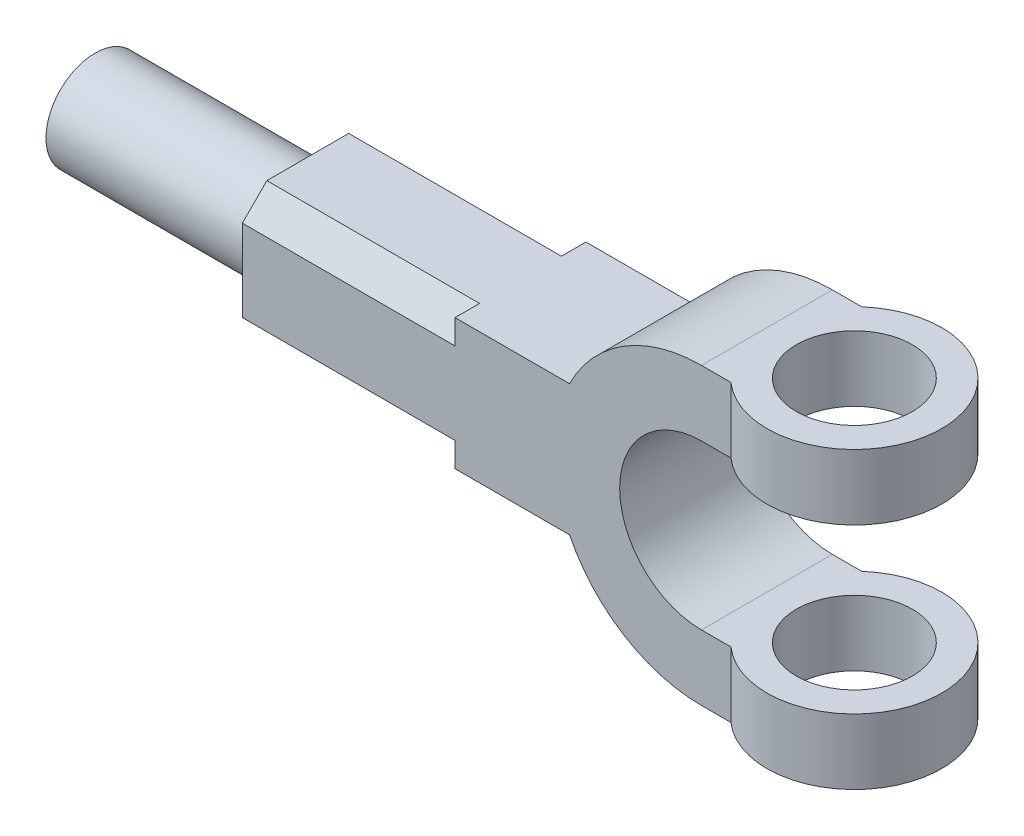
ISO-10303-21;
HEADER;
FILE_DESCRIPTION(('STEP AP214'),'2;1');
FILE_NAME('part.step','',(''),(''),'','','');
FILE_SCHEMA(('AUTOMOTIVE_DESIGN { 1 0 10303 214 1 1 1 1 }'));
ENDSEC;
DATA;
#1=APPLICATION_CONTEXT('core data for automotive mechanical design processes');
#2=APPLICATION_PROTOCOL_DEFINITION('international standard','automotive_design',2000,#1);
#3=PRODUCT_CONTEXT('',#1,'mechanical');
#4=PRODUCT('Part','Part','',(#3));
#5=PRODUCT_RELATED_PRODUCT_CATEGORY('part','',(#4));
#6=PRODUCT_DEFINITION_FORMATION('','',#4);
#7=PRODUCT_DEFINITION_CONTEXT('part definition',#1,'design');
#8=PRODUCT_DEFINITION('design','',#6,#7);
#9=PRODUCT_DEFINITION_SHAPE('','',#8);
#10=(LENGTH_UNIT() NAMED_UNIT(*) SI_UNIT(.MILLI.,.METRE.));
#11=(NAMED_UNIT(*) PLANE_ANGLE_UNIT() SI_UNIT($,.RADIAN.));
#12=(NAMED_UNIT(*) SI_UNIT($,.STERADIAN.) SOLID_ANGLE_UNIT());
#13=UNCERTAINTY_MEASURE_WITH_UNIT(LENGTH_MEASURE(1.E-05),#10,'distance_accuracy_value','');
#14=(GEOMETRIC_REPRESENTATION_CONTEXT(3) GLOBAL_UNCERTAINTY_ASSIGNED_CONTEXT((#13)) GLOBAL_UNIT_ASSIGNED_CONTEXT((#10,
#11,#12)) REPRESENTATION_CONTEXT('',''));
#15=CARTESIAN_POINT('',(0.,0.,0.));
#16=DIRECTION('',(0.,0.,1.));
#17=DIRECTION('',(1.,0.,0.));
#18=AXIS2_PLACEMENT_3D('',#15,#16,#17);
#19=CARTESIAN_POINT('',(-140.311288741493,0.,20.));
#20=DIRECTION('',(1.,0.,0.));
#21=DIRECTION('',(0.,0.,-1.));
#22=AXIS2_PLACEMENT_3D('',#19,#20,#21);
#23=PLANE('',#22);
#24=DIRECTION('',(0.,-1.,0.));
#25=VECTOR('',#24,1.);
#26=CARTESIAN_POINT('',(-140.311288741493,0.,-20.));
#27=LINE('',#26,#25);
#28=CARTESIAN_POINT('',(-140.311288741493,12.5,-20.));
#29=VERTEX_POINT('',#28);
#30=CARTESIAN_POINT('',(-140.311288741493,-12.4999999999998,-20.0000000000002));
#31=VERTEX_POINT('',#30);
#32=EDGE_CURVE('E320',#29,#31,#27,.T.);
#33=ORIENTED_EDGE('',*,*,#32,.T.);
#34=DIRECTION('',(0.,0.707106781186552,-0.707106781186543));
#35=VECTOR('',#34,1.);
#36=CARTESIAN_POINT('',(-140.311288741493,-12.4999999999998,-20.0000000000002));
#37=LINE('',#36,#35);
#38=CARTESIAN_POINT('',(-140.311288741493,-19.9999999999999,-12.5000000000002));
#39=VERTEX_POINT('',#38);
#40=EDGE_CURVE('E203',#39,#31,#37,.T.);
#41=ORIENTED_EDGE('',*,*,#40,.F.);
#42=DIRECTION('',(0.,0.,-1.));
#43=VECTOR('',#42,1.);
#44=CARTESIAN_POINT('',(-140.311288741493,-20.,20.));
#45=LINE('',#44,#43);
#46=CARTESIAN_POINT('',(-140.311288741493,-20.,12.5));
#47=VERTEX_POINT('',#46);
#48=EDGE_CURVE('E208',#47,#39,#45,.T.);
#49=ORIENTED_EDGE('',*,*,#48,.F.);
#50=DIRECTION('',(0.,-0.70710678118655,-0.707106781186545));
#51=VECTOR('',#50,1.);
#52=CARTESIAN_POINT('',(-140.311288741493,-20.,12.5));
#53=LINE('',#52,#51);
#54=CARTESIAN_POINT('',(-140.311288741493,-12.5,20.));
#55=VERTEX_POINT('',#54);
#56=EDGE_CURVE('E215',#55,#47,#53,.T.);
#57=ORIENTED_EDGE('',*,*,#56,.F.);
#58=DIRECTION('',(0.,-1.,0.));
#59=VECTOR('',#58,1.);
#60=CARTESIAN_POINT('',(-140.311288741493,0.,20.));
#61=LINE('',#60,#59);
#62=CARTESIAN_POINT('',(-140.311288741493,12.4999999999999,20.0000000000001));
#63=VERTEX_POINT('',#62);
#64=EDGE_CURVE('E352',#63,#55,#61,.T.);
#65=ORIENTED_EDGE('',*,*,#64,.F.);
#66=DIRECTION('',(0.,-0.707106781186547,0.707106781186548));
#67=VECTOR('',#66,1.);
#68=CARTESIAN_POINT('',(-140.311288741493,12.4999999999999,20.0000000000001));
#69=LINE('',#68,#67);
#70=CARTESIAN_POINT('',(-140.311288741493,20.,12.5));
#71=VERTEX_POINT('',#70);
#72=EDGE_CURVE('E234',#71,#63,#69,.T.);
#73=ORIENTED_EDGE('',*,*,#72,.F.);
#74=DIRECTION('',(0.,0.,-1.));
#75=VECTOR('',#74,1.);
#76=CARTESIAN_POINT('',(-140.311288741493,20.,20.));
#77=LINE('',#76,#75);
#78=CARTESIAN_POINT('',(-140.311288741493,20.,-12.5));
#79=VERTEX_POINT('',#78);
#80=EDGE_CURVE('E400',#71,#79,#77,.T.);
#81=ORIENTED_EDGE('',*,*,#80,.T.);
#82=DIRECTION('',(0.,0.70710678118655,0.707106781186545));
#83=VECTOR('',#82,1.);
#84=CARTESIAN_POINT('',(-140.311288741493,20.,-12.5));
#85=LINE('',#84,#83);
#86=EDGE_CURVE('E260',#29,#79,#85,.T.);
#87=ORIENTED_EDGE('',*,*,#86,.F.);
#88=EDGE_LOOP('',(#33,#41,#49,#57,#65,#73,#81,#87));
#89=FACE_BOUND('',#88,.T.);
#90=CARTESIAN_POINT('',(-140.311288741493,0.,0.));
#91=DIRECTION('',(1.,0.,0.));
#92=DIRECTION('',(0.,0.,-1.));
#93=AXIS2_PLACEMENT_3D('',#90,#91,#92);
#94=CIRCLE('',#93,15.);
#95=CARTESIAN_POINT('',(-140.311288741493,0.,-15.));
#96=VERTEX_POINT('',#95);
#97=EDGE_CURVE('E11',#96,#96,#94,.F.);
#98=ORIENTED_EDGE('',*,*,#97,.F.);
#99=EDGE_LOOP('',(#98));
#100=FACE_BOUND('',#99,.T.);
#101=ADVANCED_FACE('F48',(#89,#100),#23,.F.);
#102=CARTESIAN_POINT('',(0.,-20.,20.));
#103=DIRECTION('',(0.,-1.,0.));
#104=DIRECTION('',(1.,0.,0.));
#105=AXIS2_PLACEMENT_3D('',#102,#103,#104);
#106=PLANE('',#105);
#107=DIRECTION('',(-1.,0.,0.));
#108=VECTOR('',#107,1.);
#109=CARTESIAN_POINT('',(-75.3112887414927,-19.9999999999999,-12.5000000000002));
#110=LINE('',#109,#108);
#111=CARTESIAN_POINT('',(-75.3112887414927,-19.9999999999999,-12.5000000000002));
#112=VERTEX_POINT('',#111);
#113=EDGE_CURVE('E188',#112,#39,#110,.T.);
#114=ORIENTED_EDGE('',*,*,#113,.F.);
#115=DIRECTION('',(0.,0.,1.));
#116=VECTOR('',#115,1.);
#117=CARTESIAN_POINT('',(-75.3112887414927,-19.9999999999998,-20.0000000000002));
#118=LINE('',#117,#116);
#119=CARTESIAN_POINT('',(-75.3112887414927,-19.9999999999998,-20.0000000000002));
#120=VERTEX_POINT('',#119);
#121=EDGE_CURVE('E195',#120,#112,#118,.T.);
#122=ORIENTED_EDGE('',*,*,#121,.F.);
#123=DIRECTION('',(-1.,0.,0.));
#124=VECTOR('',#123,1.);
#125=CARTESIAN_POINT('',(0.,-20.,-20.));
#126=LINE('',#125,#124);
#127=CARTESIAN_POINT('',(-40.3112887414927,-20.,-20.));
#128=VERTEX_POINT('',#127);
#129=EDGE_CURVE('E311',#128,#120,#126,.T.);
#130=ORIENTED_EDGE('',*,*,#129,.F.);
#131=DIRECTION('',(0.,0.,-1.));
#132=VECTOR('',#131,1.);
#133=CARTESIAN_POINT('',(-40.3112887414927,-20.,20.));
#134=LINE('',#133,#132);
#135=CARTESIAN_POINT('',(-40.3112887414927,-20.,20.));
#136=VERTEX_POINT('',#135);
#137=EDGE_CURVE('E57',#136,#128,#134,.T.);
#138=ORIENTED_EDGE('',*,*,#137,.F.);
#139=DIRECTION('',(-1.,0.,0.));
#140=VECTOR('',#139,1.);
#141=CARTESIAN_POINT('',(0.,-20.,20.));
#142=LINE('',#141,#140);
#143=CARTESIAN_POINT('',(-75.3112887414927,-20.,20.));
#144=VERTEX_POINT('',#143);
#145=EDGE_CURVE('E315',#136,#144,#142,.T.);
#146=ORIENTED_EDGE('',*,*,#145,.T.);
#147=DIRECTION('',(0.,0.,1.));
#148=VECTOR('',#147,1.);
#149=CARTESIAN_POINT('',(-75.3112887414927,-20.,12.5));
#150=LINE('',#149,#148);
#151=CARTESIAN_POINT('',(-75.3112887414927,-20.,12.5));
#152=VERTEX_POINT('',#151);
#153=EDGE_CURVE('E72',#152,#144,#150,.T.);
#154=ORIENTED_EDGE('',*,*,#153,.F.);
#155=DIRECTION('',(-1.,0.,0.));
#156=VECTOR('',#155,1.);
#157=CARTESIAN_POINT('',(-75.3112887414927,-20.,12.5));
#158=LINE('',#157,#156);
#159=EDGE_CURVE('E231',#152,#47,#158,.T.);
#160=ORIENTED_EDGE('',*,*,#159,.T.);
#161=ORIENTED_EDGE('',*,*,#48,.T.);
#162=EDGE_LOOP('',(#114,#122,#130,#138,#146,#154,#160,#161));
#163=FACE_BOUND('',#162,.T.);
#164=ADVANCED_FACE('F50',(#163),#106,.T.);
#165=CARTESIAN_POINT('',(0.,0.,20.));
#166=DIRECTION('',(0.,0.,-1.));
#167=DIRECTION('',(-1.,0.,0.));
#168=AXIS2_PLACEMENT_3D('',#165,#166,#167);
#169=CYLINDRICAL_SURFACE('',#168,45.);
#170=CARTESIAN_POINT('',(0.,0.,-20.));
#171=DIRECTION('',(0.,0.,1.));
#172=DIRECTION('',(1.,0.,0.));
#173=AXIS2_PLACEMENT_3D('',#170,#171,#172);
#174=CIRCLE('',#173,45.);
#175=CARTESIAN_POINT('',(0.,-45.,-20.));
#176=VERTEX_POINT('',#175);
#177=EDGE_CURVE('E358',#128,#176,#174,.T.);
#178=ORIENTED_EDGE('',*,*,#177,.T.);
#179=DIRECTION('',(0.,0.,-1.));
#180=VECTOR('',#179,1.);
#181=CARTESIAN_POINT('',(0.,-45.,20.));
#182=LINE('',#181,#180);
#183=CARTESIAN_POINT('',(0.,-45.,20.));
#184=VERTEX_POINT('',#183);
#185=EDGE_CURVE('E416',#184,#176,#182,.T.);
#186=ORIENTED_EDGE('',*,*,#185,.F.);
#187=CARTESIAN_POINT('',(0.,0.,20.));
#188=DIRECTION('',(0.,0.,1.));
#189=DIRECTION('',(1.,0.,0.));
#190=AXIS2_PLACEMENT_3D('',#187,#188,#189);
#191=CIRCLE('',#190,45.);
#192=EDGE_CURVE('E319',#136,#184,#191,.T.);
#193=ORIENTED_EDGE('',*,*,#192,.F.);
#194=ORIENTED_EDGE('',*,*,#137,.T.);
#195=EDGE_LOOP('',(#178,#186,#193,#194));
#196=FACE_BOUND('',#195,.T.);
#197=ADVANCED_FACE('F424',(#196),#169,.T.);
#198=CARTESIAN_POINT('',(0.,-45.,20.));
#199=DIRECTION('',(0.,1.,0.));
#200=DIRECTION('',(0.,0.,1.));
#201=AXIS2_PLACEMENT_3D('',#198,#199,#200);
#202=PLANE('',#201);
#203=CARTESIAN_POINT('',(26.7222222222222,-45.,0.));
#204=DIRECTION('',(0.,1.,0.));
#205=DIRECTION('',(0.,0.,1.));
#206=AXIS2_PLACEMENT_3D('',#203,#204,#205);
#207=CIRCLE('',#206,17.7222222222222);
#208=CARTESIAN_POINT('',(26.7222222222222,-45.,17.7222222222222));
#209=VERTEX_POINT('',#208);
#210=EDGE_CURVE('E280',#209,#209,#207,.T.);
#211=ORIENTED_EDGE('',*,*,#210,.T.);
#212=EDGE_LOOP('',(#211));
#213=FACE_BOUND('',#212,.T.);
#214=CARTESIAN_POINT('',(26.7222222222222,-45.,0.));
#215=DIRECTION('',(0.,1.,0.));
#216=DIRECTION('',(0.,0.,1.));
#217=AXIS2_PLACEMENT_3D('',#214,#215,#216);
#218=CIRCLE('',#217,26.7222222222222);
#219=CARTESIAN_POINT('',(8.99999999999999,-45.,20.));
#220=VERTEX_POINT('',#219);
#221=CARTESIAN_POINT('',(8.99999999999999,-45.,-20.));
#222=VERTEX_POINT('',#221);
#223=EDGE_CURVE('E287',#220,#222,#218,.T.);
#224=ORIENTED_EDGE('',*,*,#223,.F.);
#225=DIRECTION('',(1.,0.,0.));
#226=VECTOR('',#225,1.);
#227=CARTESIAN_POINT('',(0.,-45.,20.));
#228=LINE('',#227,#226);
#229=EDGE_CURVE('E323',#184,#220,#228,.T.);
#230=ORIENTED_EDGE('',*,*,#229,.F.);
#231=ORIENTED_EDGE('',*,*,#185,.T.);
#232=DIRECTION('',(1.,0.,0.));
#233=VECTOR('',#232,1.);
#234=CARTESIAN_POINT('',(0.,-45.,-20.));
#235=LINE('',#234,#233);
#236=EDGE_CURVE('E362',#176,#222,#235,.T.);
#237=ORIENTED_EDGE('',*,*,#236,.T.);
#238=EDGE_LOOP('',(#224,#230,#231,#237));
#239=FACE_BOUND('',#238,.T.);
#240=ADVANCED_FACE('F433',(#213,#239),#202,.F.);
#241=CARTESIAN_POINT('',(0.,-25.,20.));
#242=DIRECTION('',(0.,-1.,0.));
#243=DIRECTION('',(0.,0.,-1.));
#244=AXIS2_PLACEMENT_3D('',#241,#242,#243);
#245=PLANE('',#244);
#246=CARTESIAN_POINT('',(26.7222222222222,-25.,0.));
#247=DIRECTION('',(0.,1.,0.));
#248=DIRECTION('',(0.,0.,1.));
#249=AXIS2_PLACEMENT_3D('',#246,#247,#248);
#250=CIRCLE('',#249,17.7222222222222);
#251=CARTESIAN_POINT('',(26.7222222222222,-25.,17.7222222222222));
#252=VERTEX_POINT('',#251);
#253=EDGE_CURVE('E283',#252,#252,#250,.T.);
#254=ORIENTED_EDGE('',*,*,#253,.F.);
#255=EDGE_LOOP('',(#254));
#256=FACE_BOUND('',#255,.T.);
#257=CARTESIAN_POINT('',(26.7222222222222,-25.,0.));
#258=DIRECTION('',(0.,1.,0.));
#259=DIRECTION('',(0.,0.,1.));
#260=AXIS2_PLACEMENT_3D('',#257,#258,#259);
#261=CIRCLE('',#260,26.7222222222222);
#262=CARTESIAN_POINT('',(8.99999999999999,-25.,20.));
#263=VERTEX_POINT('',#262);
#264=CARTESIAN_POINT('',(9.00000000000001,-25.,-20.));
#265=VERTEX_POINT('',#264);
#266=EDGE_CURVE('E291',#263,#265,#261,.T.);
#267=ORIENTED_EDGE('',*,*,#266,.T.);
#268=DIRECTION('',(-1.,0.,0.));
#269=VECTOR('',#268,1.);
#270=CARTESIAN_POINT('',(0.,-25.,-20.));
#271=LINE('',#270,#269);
#272=CARTESIAN_POINT('',(0.,-25.,-20.));
#273=VERTEX_POINT('',#272);
#274=EDGE_CURVE('E369',#265,#273,#271,.T.);
#275=ORIENTED_EDGE('',*,*,#274,.T.);
#276=DIRECTION('',(0.,0.,-1.));
#277=VECTOR('',#276,1.);
#278=CARTESIAN_POINT('',(0.,-25.,20.));
#279=LINE('',#278,#277);
#280=CARTESIAN_POINT('',(0.,-25.,20.));
#281=VERTEX_POINT('',#280);
#282=EDGE_CURVE('E413',#281,#273,#279,.T.);
#283=ORIENTED_EDGE('',*,*,#282,.F.);
#284=DIRECTION('',(-1.,0.,0.));
#285=VECTOR('',#284,1.);
#286=CARTESIAN_POINT('',(0.,-25.,20.));
#287=LINE('',#286,#285);
#288=EDGE_CURVE('E329',#263,#281,#287,.T.);
#289=ORIENTED_EDGE('',*,*,#288,.F.);
#290=EDGE_LOOP('',(#267,#275,#283,#289));
#291=FACE_BOUND('',#290,.T.);
#292=ADVANCED_FACE('F444',(#256,#291),#245,.F.);
#293=CARTESIAN_POINT('',(0.,0.,20.));
#294=DIRECTION('',(0.,0.,-1.));
#295=DIRECTION('',(-1.,0.,0.));
#296=AXIS2_PLACEMENT_3D('',#293,#294,#295);
#297=CYLINDRICAL_SURFACE('',#296,25.);
#298=CARTESIAN_POINT('',(0.,0.,-20.));
#299=DIRECTION('',(0.,0.,1.));
#300=DIRECTION('',(1.,0.,0.));
#301=AXIS2_PLACEMENT_3D('',#298,#299,#300);
#302=CIRCLE('',#301,25.);
#303=CARTESIAN_POINT('',(0.,25.,-20.));
#304=VERTEX_POINT('',#303);
#305=EDGE_CURVE('E373',#304,#273,#302,.T.);
#306=ORIENTED_EDGE('',*,*,#305,.F.);
#307=DIRECTION('',(0.,0.,-1.));
#308=VECTOR('',#307,1.);
#309=CARTESIAN_POINT('',(0.,25.,20.));
#310=LINE('',#309,#308);
#311=CARTESIAN_POINT('',(0.,25.,20.));
#312=VERTEX_POINT('',#311);
#313=EDGE_CURVE('E410',#312,#304,#310,.T.);
#314=ORIENTED_EDGE('',*,*,#313,.F.);
#315=CARTESIAN_POINT('',(0.,0.,20.));
#316=DIRECTION('',(0.,0.,1.));
#317=DIRECTION('',(1.,0.,0.));
#318=AXIS2_PLACEMENT_3D('',#315,#316,#317);
#319=CIRCLE('',#318,25.);
#320=EDGE_CURVE('E332',#312,#281,#319,.T.);
#321=ORIENTED_EDGE('',*,*,#320,.T.);
#322=ORIENTED_EDGE('',*,*,#282,.T.);
#323=EDGE_LOOP('',(#306,#314,#321,#322));
#324=FACE_BOUND('',#323,.T.);
#325=ADVANCED_FACE('F451',(#324),#297,.F.);
#326=CARTESIAN_POINT('',(0.,25.,20.));
#327=DIRECTION('',(0.,1.,0.));
#328=DIRECTION('',(0.,0.,1.));
#329=AXIS2_PLACEMENT_3D('',#326,#327,#328);
#330=PLANE('',#329);
#331=ORIENTED_EDGE('',*,*,#313,.T.);
#332=DIRECTION('',(1.,0.,0.));
#333=VECTOR('',#332,1.);
#334=CARTESIAN_POINT('',(0.,25.,-20.));
#335=LINE('',#334,#333);
#336=CARTESIAN_POINT('',(8.99999999999999,25.,-20.));
#337=VERTEX_POINT('',#336);
#338=EDGE_CURVE('E377',#304,#337,#335,.T.);
#339=ORIENTED_EDGE('',*,*,#338,.T.);
#340=CARTESIAN_POINT('',(26.7222222222222,25.,0.));
#341=DIRECTION('',(0.,1.,0.));
#342=DIRECTION('',(0.,0.,1.));
#343=AXIS2_PLACEMENT_3D('',#340,#341,#342);
#344=CIRCLE('',#343,26.7222222222222);
#345=CARTESIAN_POINT('',(8.99999999999999,25.,20.));
#346=VERTEX_POINT('',#345);
#347=EDGE_CURVE('E307',#346,#337,#344,.T.);
#348=ORIENTED_EDGE('',*,*,#347,.F.);
#349=DIRECTION('',(1.,0.,0.));
#350=VECTOR('',#349,1.);
#351=CARTESIAN_POINT('',(0.,25.,20.));
#352=LINE('',#351,#350);
#353=EDGE_CURVE('E336',#312,#346,#352,.T.);
#354=ORIENTED_EDGE('',*,*,#353,.F.);
#355=EDGE_LOOP('',(#331,#339,#348,#354));
#356=FACE_BOUND('',#355,.T.);
#357=CARTESIAN_POINT('',(26.7222222222222,25.,0.));
#358=DIRECTION('',(0.,1.,0.));
#359=DIRECTION('',(0.,0.,1.));
#360=AXIS2_PLACEMENT_3D('',#357,#358,#359);
#361=CIRCLE('',#360,17.7222222222222);
#362=CARTESIAN_POINT('',(26.7222222222222,25.,17.7222222222222));
#363=VERTEX_POINT('',#362);
#364=EDGE_CURVE('E299',#363,#363,#361,.T.);
#365=ORIENTED_EDGE('',*,*,#364,.T.);
#366=EDGE_LOOP('',(#365));
#367=FACE_BOUND('',#366,.T.);
#368=ADVANCED_FACE('F455',(#356,#367),#330,.F.);
#369=CARTESIAN_POINT('',(0.,45.,20.));
#370=DIRECTION('',(0.,-1.,0.));
#371=DIRECTION('',(0.,0.,-1.));
#372=AXIS2_PLACEMENT_3D('',#369,#370,#371);
#373=PLANE('',#372);
#374=CARTESIAN_POINT('',(26.7222222222222,45.,0.));
#375=DIRECTION('',(0.,1.,0.));
#376=DIRECTION('',(0.,0.,1.));
#377=AXIS2_PLACEMENT_3D('',#374,#375,#376);
#378=CIRCLE('',#377,17.7222222222222);
#379=CARTESIAN_POINT('',(26.7222222222222,45.,17.7222222222222));
#380=VERTEX_POINT('',#379);
#381=EDGE_CURVE('E295',#380,#380,#378,.T.);
#382=ORIENTED_EDGE('',*,*,#381,.F.);
#383=EDGE_LOOP('',(#382));
#384=FACE_BOUND('',#383,.T.);
#385=DIRECTION('',(-1.,0.,0.));
#386=VECTOR('',#385,1.);
#387=CARTESIAN_POINT('',(0.,45.,-20.));
#388=LINE('',#387,#386);
#389=CARTESIAN_POINT('',(9.00000000000001,45.,-20.));
#390=VERTEX_POINT('',#389);
#391=CARTESIAN_POINT('',(0.,45.,-20.));
#392=VERTEX_POINT('',#391);
#393=EDGE_CURVE('E384',#390,#392,#388,.T.);
#394=ORIENTED_EDGE('',*,*,#393,.T.);
#395=DIRECTION('',(0.,0.,-1.));
#396=VECTOR('',#395,1.);
#397=CARTESIAN_POINT('',(0.,45.,20.));
#398=LINE('',#397,#396);
#399=CARTESIAN_POINT('',(0.,45.,20.));
#400=VERTEX_POINT('',#399);
#401=EDGE_CURVE('E407',#400,#392,#398,.T.);
#402=ORIENTED_EDGE('',*,*,#401,.F.);
#403=DIRECTION('',(-1.,0.,0.));
#404=VECTOR('',#403,1.);
#405=CARTESIAN_POINT('',(0.,45.,20.));
#406=LINE('',#405,#404);
#407=CARTESIAN_POINT('',(8.99999999999999,45.,20.));
#408=VERTEX_POINT('',#407);
#409=EDGE_CURVE('E342',#408,#400,#406,.T.);
#410=ORIENTED_EDGE('',*,*,#409,.F.);
#411=CARTESIAN_POINT('',(26.7222222222222,45.,0.));
#412=DIRECTION('',(0.,1.,0.));
#413=DIRECTION('',(0.,0.,1.));
#414=AXIS2_PLACEMENT_3D('',#411,#412,#413);
#415=CIRCLE('',#414,26.7222222222222);
#416=EDGE_CURVE('E303',#408,#390,#415,.T.);
#417=ORIENTED_EDGE('',*,*,#416,.T.);
#418=EDGE_LOOP('',(#394,#402,#410,#417));
#419=FACE_BOUND('',#418,.T.);
#420=ADVANCED_FACE('F464',(#384,#419),#373,.F.);
#421=CARTESIAN_POINT('',(0.,0.,20.));
#422=DIRECTION('',(0.,0.,-1.));
#423=DIRECTION('',(-1.,0.,0.));
#424=AXIS2_PLACEMENT_3D('',#421,#422,#423);
#425=CYLINDRICAL_SURFACE('',#424,45.);
#426=CARTESIAN_POINT('',(0.,0.,-20.));
#427=DIRECTION('',(0.,0.,1.));
#428=DIRECTION('',(1.,0.,0.));
#429=AXIS2_PLACEMENT_3D('',#426,#427,#428);
#430=CIRCLE('',#429,45.);
#431=CARTESIAN_POINT('',(-40.3112887414927,20.,-20.));
#432=VERTEX_POINT('',#431);
#433=EDGE_CURVE('E388',#392,#432,#430,.T.);
#434=ORIENTED_EDGE('',*,*,#433,.T.);
#435=DIRECTION('',(0.,0.,-1.));
#436=VECTOR('',#435,1.);
#437=CARTESIAN_POINT('',(-40.3112887414927,20.,20.));
#438=LINE('',#437,#436);
#439=CARTESIAN_POINT('',(-40.3112887414927,20.,20.));
#440=VERTEX_POINT('',#439);
#441=EDGE_CURVE('E403',#440,#432,#438,.T.);
#442=ORIENTED_EDGE('',*,*,#441,.F.);
#443=CARTESIAN_POINT('',(0.,0.,20.));
#444=DIRECTION('',(0.,0.,1.));
#445=DIRECTION('',(1.,0.,0.));
#446=AXIS2_PLACEMENT_3D('',#443,#444,#445);
#447=CIRCLE('',#446,45.);
#448=EDGE_CURVE('E345',#400,#440,#447,.T.);
#449=ORIENTED_EDGE('',*,*,#448,.F.);
#450=ORIENTED_EDGE('',*,*,#401,.T.);
#451=EDGE_LOOP('',(#434,#442,#449,#450));
#452=FACE_BOUND('',#451,.T.);
#453=ADVANCED_FACE('F469',(#452),#425,.T.);
#454=CARTESIAN_POINT('',(0.,20.,20.));
#455=DIRECTION('',(0.,-1.,0.));
#456=DIRECTION('',(1.,0.,0.));
#457=AXIS2_PLACEMENT_3D('',#454,#455,#456);
#458=PLANE('',#457);
#459=ORIENTED_EDGE('',*,*,#80,.F.);
#460=DIRECTION('',(-1.,0.,0.));
#461=VECTOR('',#460,1.);
#462=CARTESIAN_POINT('',(-75.3112887414927,20.,12.5));
#463=LINE('',#462,#461);
#464=CARTESIAN_POINT('',(-75.3112887414927,20.,12.5));
#465=VERTEX_POINT('',#464);
#466=EDGE_CURVE('E247',#465,#71,#463,.T.);
#467=ORIENTED_EDGE('',*,*,#466,.F.);
#468=DIRECTION('',(0.,0.,-1.));
#469=VECTOR('',#468,1.);
#470=CARTESIAN_POINT('',(-75.3112887414927,19.9999999999999,20.0000000000001));
#471=LINE('',#470,#469);
#472=CARTESIAN_POINT('',(-75.3112887414927,19.9999999999999,20.0000000000001));
#473=VERTEX_POINT('',#472);
#474=EDGE_CURVE('E237',#473,#465,#471,.T.);
#475=ORIENTED_EDGE('',*,*,#474,.F.);
#476=DIRECTION('',(-1.,0.,0.));
#477=VECTOR('',#476,1.);
#478=CARTESIAN_POINT('',(0.,20.,20.));
#479=LINE('',#478,#477);
#480=EDGE_CURVE('E348',#440,#473,#479,.T.);
#481=ORIENTED_EDGE('',*,*,#480,.F.);
#482=ORIENTED_EDGE('',*,*,#441,.T.);
#483=DIRECTION('',(-1.,0.,0.));
#484=VECTOR('',#483,1.);
#485=CARTESIAN_POINT('',(0.,20.,-20.));
#486=LINE('',#485,#484);
#487=CARTESIAN_POINT('',(-75.3112887414927,20.,-20.));
#488=VERTEX_POINT('',#487);
#489=EDGE_CURVE('E391',#432,#488,#486,.T.);
#490=ORIENTED_EDGE('',*,*,#489,.T.);
#491=DIRECTION('',(0.,0.,-1.));
#492=VECTOR('',#491,1.);
#493=CARTESIAN_POINT('',(-75.3112887414927,20.,-12.5));
#494=LINE('',#493,#492);
#495=CARTESIAN_POINT('',(-75.3112887414927,20.,-12.5));
#496=VERTEX_POINT('',#495);
#497=EDGE_CURVE('E269',#496,#488,#494,.T.);
#498=ORIENTED_EDGE('',*,*,#497,.F.);
#499=DIRECTION('',(-1.,0.,0.));
#500=VECTOR('',#499,1.);
#501=CARTESIAN_POINT('',(-75.3112887414927,20.,-12.5));
#502=LINE('',#501,#500);
#503=EDGE_CURVE('E276',#496,#79,#502,.T.);
#504=ORIENTED_EDGE('',*,*,#503,.T.);
#505=EDGE_LOOP('',(#459,#467,#475,#481,#482,#490,#498,#504));
#506=FACE_BOUND('',#505,.T.);
#507=ADVANCED_FACE('F475',(#506),#458,.F.);
#508=CARTESIAN_POINT('',(0.,0.,20.));
#509=DIRECTION('',(0.,0.,1.));
#510=DIRECTION('',(1.,0.,0.));
#511=AXIS2_PLACEMENT_3D('',#508,#509,#510);
#512=PLANE('',#511);
#513=DIRECTION('',(-1.,0.,0.));
#514=VECTOR('',#513,1.);
#515=CARTESIAN_POINT('',(-75.3112887414927,-12.5,20.));
#516=LINE('',#515,#514);
#517=CARTESIAN_POINT('',(-75.3112887414927,-12.5,20.));
#518=VERTEX_POINT('',#517);
#519=EDGE_CURVE('E228',#518,#55,#516,.T.);
#520=ORIENTED_EDGE('',*,*,#519,.F.);
#521=DIRECTION('',(0.,1.,0.));
#522=VECTOR('',#521,1.);
#523=CARTESIAN_POINT('',(-75.3112887414927,-20.,20.));
#524=LINE('',#523,#522);
#525=EDGE_CURVE('E220',#144,#518,#524,.T.);
#526=ORIENTED_EDGE('',*,*,#525,.F.);
#527=ORIENTED_EDGE('',*,*,#145,.F.);
#528=ORIENTED_EDGE('',*,*,#192,.T.);
#529=ORIENTED_EDGE('',*,*,#229,.T.);
#530=DIRECTION('',(0.,1.,0.));
#531=VECTOR('',#530,1.);
#532=CARTESIAN_POINT('',(8.99999999999999,0.,20.));
#533=LINE('',#532,#531);
#534=EDGE_CURVE('E326',#220,#263,#533,.T.);
#535=ORIENTED_EDGE('',*,*,#534,.T.);
#536=ORIENTED_EDGE('',*,*,#288,.T.);
#537=ORIENTED_EDGE('',*,*,#320,.F.);
#538=ORIENTED_EDGE('',*,*,#353,.T.);
#539=DIRECTION('',(0.,1.,0.));
#540=VECTOR('',#539,1.);
#541=CARTESIAN_POINT('',(8.99999999999999,0.,20.));
#542=LINE('',#541,#540);
#543=EDGE_CURVE('E339',#346,#408,#542,.T.);
#544=ORIENTED_EDGE('',*,*,#543,.T.);
#545=ORIENTED_EDGE('',*,*,#409,.T.);
#546=ORIENTED_EDGE('',*,*,#448,.T.);
#547=ORIENTED_EDGE('',*,*,#480,.T.);
#548=DIRECTION('',(0.,1.,0.));
#549=VECTOR('',#548,1.);
#550=CARTESIAN_POINT('',(-75.3112887414927,12.4999999999999,20.0000000000001));
#551=LINE('',#550,#549);
#552=CARTESIAN_POINT('',(-75.3112887414927,12.4999999999999,20.));
#553=VERTEX_POINT('',#552);
#554=EDGE_CURVE('E244',#553,#473,#551,.T.);
#555=ORIENTED_EDGE('',*,*,#554,.F.);
#556=DIRECTION('',(-1.,0.,0.));
#557=VECTOR('',#556,1.);
#558=CARTESIAN_POINT('',(-75.3112887414927,12.4999999999999,20.0000000000001));
#559=LINE('',#558,#557);
#560=EDGE_CURVE('E250',#553,#63,#559,.T.);
#561=ORIENTED_EDGE('',*,*,#560,.T.);
#562=ORIENTED_EDGE('',*,*,#64,.T.);
#563=EDGE_LOOP('',(#520,#526,#527,#528,#529,#535,#536,#537,#538,#544,#545,#546,#547,#555,#561,#562));
#564=FACE_BOUND('',#563,.T.);
#565=ADVANCED_FACE('F438',(#564),#512,.T.);
#566=CARTESIAN_POINT('',(0.,0.,-20.));
#567=DIRECTION('',(0.,0.,1.));
#568=DIRECTION('',(1.,0.,0.));
#569=AXIS2_PLACEMENT_3D('',#566,#567,#568);
#570=PLANE('',#569);
#571=DIRECTION('',(0.,-1.,0.));
#572=VECTOR('',#571,1.);
#573=CARTESIAN_POINT('',(-75.3112887414927,-12.4999999999998,-20.0000000000002));
#574=LINE('',#573,#572);
#575=CARTESIAN_POINT('',(-75.3112887414927,-12.4999999999998,-20.));
#576=VERTEX_POINT('',#575);
#577=EDGE_CURVE('E194',#576,#120,#574,.T.);
#578=ORIENTED_EDGE('',*,*,#577,.F.);
#579=DIRECTION('',(-1.,0.,0.));
#580=VECTOR('',#579,1.);
#581=CARTESIAN_POINT('',(-75.3112887414927,-12.4999999999998,-20.0000000000002));
#582=LINE('',#581,#580);
#583=EDGE_CURVE('E191',#576,#31,#582,.T.);
#584=ORIENTED_EDGE('',*,*,#583,.T.);
#585=ORIENTED_EDGE('',*,*,#32,.F.);
#586=DIRECTION('',(-1.,0.,0.));
#587=VECTOR('',#586,1.);
#588=CARTESIAN_POINT('',(-75.3112887414927,12.5,-20.));
#589=LINE('',#588,#587);
#590=CARTESIAN_POINT('',(-75.3112887414927,12.5,-20.));
#591=VERTEX_POINT('',#590);
#592=EDGE_CURVE('E272',#591,#29,#589,.T.);
#593=ORIENTED_EDGE('',*,*,#592,.F.);
#594=DIRECTION('',(0.,-1.,0.));
#595=VECTOR('',#594,1.);
#596=CARTESIAN_POINT('',(-75.3112887414927,20.,-20.));
#597=LINE('',#596,#595);
#598=EDGE_CURVE('E261',#488,#591,#597,.T.);
#599=ORIENTED_EDGE('',*,*,#598,.F.);
#600=ORIENTED_EDGE('',*,*,#489,.F.);
#601=ORIENTED_EDGE('',*,*,#433,.F.);
#602=ORIENTED_EDGE('',*,*,#393,.F.);
#603=DIRECTION('',(0.,1.,0.));
#604=VECTOR('',#603,1.);
#605=CARTESIAN_POINT('',(8.99999999999999,0.,-20.));
#606=LINE('',#605,#604);
#607=EDGE_CURVE('E380',#337,#390,#606,.T.);
#608=ORIENTED_EDGE('',*,*,#607,.F.);
#609=ORIENTED_EDGE('',*,*,#338,.F.);
#610=ORIENTED_EDGE('',*,*,#305,.T.);
#611=ORIENTED_EDGE('',*,*,#274,.F.);
#612=DIRECTION('',(0.,1.,0.));
#613=VECTOR('',#612,1.);
#614=CARTESIAN_POINT('',(8.99999999999999,0.,-20.));
#615=LINE('',#614,#613);
#616=EDGE_CURVE('E365',#222,#265,#615,.T.);
#617=ORIENTED_EDGE('',*,*,#616,.F.);
#618=ORIENTED_EDGE('',*,*,#236,.F.);
#619=ORIENTED_EDGE('',*,*,#177,.F.);
#620=ORIENTED_EDGE('',*,*,#129,.T.);
#621=EDGE_LOOP('',(#578,#584,#585,#593,#599,#600,#601,#602,#608,#609,#610,#611,#617,#618,#619,#620));
#622=FACE_BOUND('',#621,.T.);
#623=ADVANCED_FACE('F429',(#622),#570,.F.);
#624=CARTESIAN_POINT('',(26.7222222222222,25.,0.));
#625=DIRECTION('',(0.,1.,0.));
#626=DIRECTION('',(0.,0.,1.));
#627=AXIS2_PLACEMENT_3D('',#624,#625,#626);
#628=CYLINDRICAL_SURFACE('',#627,26.7222222222222);
#629=ORIENTED_EDGE('',*,*,#416,.F.);
#630=ORIENTED_EDGE('',*,*,#543,.F.);
#631=ORIENTED_EDGE('',*,*,#347,.T.);
#632=ORIENTED_EDGE('',*,*,#607,.T.);
#633=EDGE_LOOP('',(#629,#630,#631,#632));
#634=FACE_BOUND('',#633,.T.);
#635=ADVANCED_FACE('F460',(#634),#628,.T.);
#636=CARTESIAN_POINT('',(26.7222222222222,25.,0.));
#637=DIRECTION('',(0.,1.,0.));
#638=DIRECTION('',(0.,0.,1.));
#639=AXIS2_PLACEMENT_3D('',#636,#637,#638);
#640=CYLINDRICAL_SURFACE('',#639,17.7222222222222);
#641=ORIENTED_EDGE('',*,*,#381,.T.);
#642=EDGE_LOOP('',(#641));
#643=FACE_BOUND('',#642,.T.);
#644=ORIENTED_EDGE('',*,*,#364,.F.);
#645=EDGE_LOOP('',(#644));
#646=FACE_BOUND('',#645,.T.);
#647=ADVANCED_FACE('F572',(#643,#646),#640,.F.);
#648=CARTESIAN_POINT('',(26.7222222222222,-25.,0.));
#649=DIRECTION('',(0.,-1.,0.));
#650=DIRECTION('',(0.,0.,-1.));
#651=AXIS2_PLACEMENT_3D('',#648,#649,#650);
#652=CYLINDRICAL_SURFACE('',#651,26.7222222222222);
#653=ORIENTED_EDGE('',*,*,#534,.F.);
#654=ORIENTED_EDGE('',*,*,#223,.T.);
#655=ORIENTED_EDGE('',*,*,#616,.T.);
#656=ORIENTED_EDGE('',*,*,#266,.F.);
#657=EDGE_LOOP('',(#653,#654,#655,#656));
#658=FACE_BOUND('',#657,.T.);
#659=ADVANCED_FACE('F442',(#658),#652,.T.);
#660=CARTESIAN_POINT('',(26.7222222222222,-25.,0.));
#661=DIRECTION('',(0.,-1.,0.));
#662=DIRECTION('',(0.,0.,-1.));
#663=AXIS2_PLACEMENT_3D('',#660,#661,#662);
#664=CYLINDRICAL_SURFACE('',#663,17.7222222222222);
#665=ORIENTED_EDGE('',*,*,#253,.T.);
#666=EDGE_LOOP('',(#665));
#667=FACE_BOUND('',#666,.T.);
#668=ORIENTED_EDGE('',*,*,#210,.F.);
#669=EDGE_LOOP('',(#668));
#670=FACE_BOUND('',#669,.T.);
#671=ADVANCED_FACE('F586',(#667,#670),#664,.F.);
#672=CARTESIAN_POINT('',(-75.3112887414927,20.,-12.5));
#673=DIRECTION('',(0.,-0.707106781186545,0.70710678118655));
#674=DIRECTION('',(0.,-0.70710678118655,-0.707106781186545));
#675=AXIS2_PLACEMENT_3D('',#672,#673,#674);
#676=PLANE('',#675);
#677=ORIENTED_EDGE('',*,*,#86,.T.);
#678=ORIENTED_EDGE('',*,*,#503,.F.);
#679=DIRECTION('',(0.,0.70710678118655,0.707106781186545));
#680=VECTOR('',#679,1.);
#681=CARTESIAN_POINT('',(-75.3112887414927,20.,-12.5));
#682=LINE('',#681,#680);
#683=EDGE_CURVE('E265',#591,#496,#682,.T.);
#684=ORIENTED_EDGE('',*,*,#683,.F.);
#685=ORIENTED_EDGE('',*,*,#592,.T.);
#686=EDGE_LOOP('',(#677,#678,#684,#685));
#687=FACE_BOUND('',#686,.T.);
#688=ADVANCED_FACE('F593',(#687),#676,.F.);
#689=CARTESIAN_POINT('',(-75.3112887414927,0.,0.));
#690=DIRECTION('',(1.,0.,0.));
#691=DIRECTION('',(0.,0.,-1.));
#692=AXIS2_PLACEMENT_3D('',#689,#690,#691);
#693=PLANE('',#692);
#694=ORIENTED_EDGE('',*,*,#598,.T.);
#695=ORIENTED_EDGE('',*,*,#683,.T.);
#696=ORIENTED_EDGE('',*,*,#497,.T.);
#697=EDGE_LOOP('',(#694,#695,#696));
#698=FACE_BOUND('',#697,.T.);
#699=ADVANCED_FACE('F601',(#698),#693,.F.);
#700=CARTESIAN_POINT('',(-205.311288741493,0.,0.));
#701=DIRECTION('',(1.,0.,0.));
#702=DIRECTION('',(0.,0.,-1.));
#703=AXIS2_PLACEMENT_3D('',#700,#701,#702);
#704=CYLINDRICAL_SURFACE('',#703,15.);
#705=CARTESIAN_POINT('',(-205.311288741493,0.,0.));
#706=DIRECTION('',(-1.,0.,0.));
#707=DIRECTION('',(0.,0.,1.));
#708=AXIS2_PLACEMENT_3D('',#705,#706,#707);
#709=CIRCLE('',#708,15.);
#710=CARTESIAN_POINT('',(-205.311288741493,0.,15.));
#711=VERTEX_POINT('',#710);
#712=EDGE_CURVE('E254',#711,#711,#709,.T.);
#713=ORIENTED_EDGE('',*,*,#712,.F.);
#714=EDGE_LOOP('',(#713));
#715=FACE_BOUND('',#714,.T.);
#716=ORIENTED_EDGE('',*,*,#97,.T.);
#717=EDGE_LOOP('',(#716));
#718=FACE_BOUND('',#717,.T.);
#719=ADVANCED_FACE('F609',(#715,#718),#704,.T.);
#720=CARTESIAN_POINT('',(-205.311288741493,0.,0.));
#721=DIRECTION('',(-1.,0.,0.));
#722=DIRECTION('',(0.,0.,1.));
#723=AXIS2_PLACEMENT_3D('',#720,#721,#722);
#724=PLANE('',#723);
#725=ORIENTED_EDGE('',*,*,#712,.T.);
#726=EDGE_LOOP('',(#725));
#727=FACE_BOUND('',#726,.T.);
#728=ADVANCED_FACE('F617',(#727),#724,.T.);
#729=CARTESIAN_POINT('',(-75.3112887414927,12.4999999999999,20.0000000000001));
#730=DIRECTION('',(0.,-0.707106781186548,-0.707106781186547));
#731=DIRECTION('',(0.,0.707106781186547,-0.707106781186548));
#732=AXIS2_PLACEMENT_3D('',#729,#730,#731);
#733=PLANE('',#732);
#734=ORIENTED_EDGE('',*,*,#72,.T.);
#735=ORIENTED_EDGE('',*,*,#560,.F.);
#736=DIRECTION('',(0.,-0.707106781186547,0.707106781186548));
#737=VECTOR('',#736,1.);
#738=CARTESIAN_POINT('',(-75.3112887414927,12.4999999999999,20.0000000000001));
#739=LINE('',#738,#737);
#740=EDGE_CURVE('E241',#465,#553,#739,.T.);
#741=ORIENTED_EDGE('',*,*,#740,.F.);
#742=ORIENTED_EDGE('',*,*,#466,.T.);
#743=EDGE_LOOP('',(#734,#735,#741,#742));
#744=FACE_BOUND('',#743,.T.);
#745=ADVANCED_FACE('F482',(#744),#733,.F.);
#746=CARTESIAN_POINT('',(-75.3112887414927,0.,0.));
#747=DIRECTION('',(1.,0.,0.));
#748=DIRECTION('',(0.,1.,0.));
#749=AXIS2_PLACEMENT_3D('',#746,#747,#748);
#750=PLANE('',#749);
#751=ORIENTED_EDGE('',*,*,#474,.T.);
#752=ORIENTED_EDGE('',*,*,#740,.T.);
#753=ORIENTED_EDGE('',*,*,#554,.T.);
#754=EDGE_LOOP('',(#751,#752,#753));
#755=FACE_BOUND('',#754,.T.);
#756=ADVANCED_FACE('F479',(#755),#750,.F.);
#757=CARTESIAN_POINT('',(-75.3112887414927,-20.,12.5));
#758=DIRECTION('',(0.,0.707106781186545,-0.70710678118655));
#759=DIRECTION('',(0.,0.70710678118655,0.707106781186545));
#760=AXIS2_PLACEMENT_3D('',#757,#758,#759);
#761=PLANE('',#760);
#762=ORIENTED_EDGE('',*,*,#56,.T.);
#763=ORIENTED_EDGE('',*,*,#159,.F.);
#764=DIRECTION('',(0.,-0.70710678118655,-0.707106781186545));
#765=VECTOR('',#764,1.);
#766=CARTESIAN_POINT('',(-75.3112887414927,-20.,12.5));
#767=LINE('',#766,#765);
#768=EDGE_CURVE('E223',#518,#152,#767,.T.);
#769=ORIENTED_EDGE('',*,*,#768,.F.);
#770=ORIENTED_EDGE('',*,*,#519,.T.);
#771=EDGE_LOOP('',(#762,#763,#769,#770));
#772=FACE_BOUND('',#771,.T.);
#773=ADVANCED_FACE('F489',(#772),#761,.F.);
#774=CARTESIAN_POINT('',(-75.3112887414927,0.,0.));
#775=DIRECTION('',(1.,0.,0.));
#776=DIRECTION('',(0.,0.,1.));
#777=AXIS2_PLACEMENT_3D('',#774,#775,#776);
#778=PLANE('',#777);
#779=ORIENTED_EDGE('',*,*,#525,.T.);
#780=ORIENTED_EDGE('',*,*,#768,.T.);
#781=ORIENTED_EDGE('',*,*,#153,.T.);
#782=EDGE_LOOP('',(#779,#780,#781));
#783=FACE_BOUND('',#782,.T.);
#784=ADVANCED_FACE('F490',(#783),#778,.F.);
#785=CARTESIAN_POINT('',(-75.3112887414927,-12.4999999999998,-20.0000000000002));
#786=DIRECTION('',(0.,0.707106781186543,0.707106781186552));
#787=DIRECTION('',(0.,-0.707106781186552,0.707106781186543));
#788=AXIS2_PLACEMENT_3D('',#785,#786,#787);
#789=PLANE('',#788);
#790=ORIENTED_EDGE('',*,*,#40,.T.);
#791=ORIENTED_EDGE('',*,*,#583,.F.);
#792=DIRECTION('',(0.,0.707106781186552,-0.707106781186543));
#793=VECTOR('',#792,1.);
#794=CARTESIAN_POINT('',(-75.3112887414927,-12.4999999999998,-20.0000000000002));
#795=LINE('',#794,#793);
#796=EDGE_CURVE('E64',#112,#576,#795,.T.);
#797=ORIENTED_EDGE('',*,*,#796,.F.);
#798=ORIENTED_EDGE('',*,*,#113,.T.);
#799=EDGE_LOOP('',(#790,#791,#797,#798));
#800=FACE_BOUND('',#799,.T.);
#801=ADVANCED_FACE('F186',(#800),#789,.F.);
#802=CARTESIAN_POINT('',(-75.3112887414927,0.,0.));
#803=DIRECTION('',(1.,0.,0.));
#804=DIRECTION('',(0.,-1.,0.));
#805=AXIS2_PLACEMENT_3D('',#802,#803,#804);
#806=PLANE('',#805);
#807=ORIENTED_EDGE('',*,*,#121,.T.);
#808=ORIENTED_EDGE('',*,*,#796,.T.);
#809=ORIENTED_EDGE('',*,*,#577,.T.);
#810=EDGE_LOOP('',(#807,#808,#809));
#811=FACE_BOUND('',#810,.T.);
#812=ADVANCED_FACE('F198',(#811),#806,.F.);
#813=CLOSED_SHELL('',(#101,#164,#197,#240,#292,#325,#368,#420,#453,#507,#565,#623,#635,#647,
#659,#671,#688,#699,#719,#728,#745,#756,#773,#784,#801,#812));
#814=MANIFOLD_SOLID_BREP('B2',#813);
#815=ADVANCED_BREP_SHAPE_REPRESENTATION('',(#18,#814),#14);
#816=SHAPE_DEFINITION_REPRESENTATION(#9,#815);
ENDSEC;
END-ISO-10303-21;
